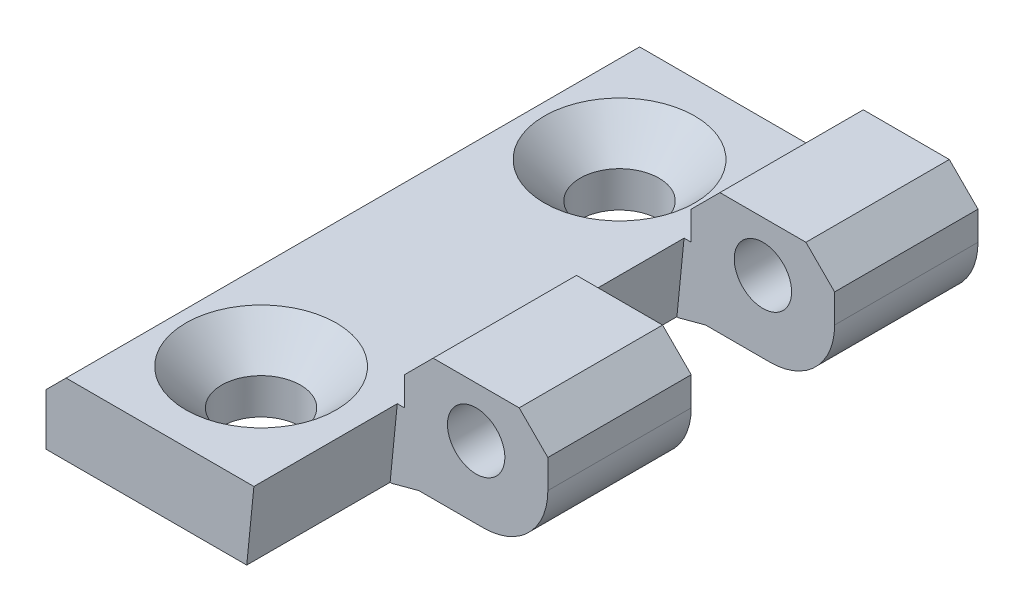
ISO-10303-21;
HEADER;
FILE_DESCRIPTION(('STEP AP214'),'2;1');
FILE_NAME('part.step','',(''),(''),'','','');
FILE_SCHEMA(('AUTOMOTIVE_DESIGN { 1 0 10303 214 1 1 1 1 }'));
ENDSEC;
DATA;
#1=APPLICATION_CONTEXT('core data for automotive mechanical design processes');
#2=APPLICATION_PROTOCOL_DEFINITION('international standard','automotive_design',2000,#1);
#3=PRODUCT_CONTEXT('',#1,'mechanical');
#4=PRODUCT('Part','Part','',(#3));
#5=PRODUCT_RELATED_PRODUCT_CATEGORY('part','',(#4));
#6=PRODUCT_DEFINITION_FORMATION('','',#4);
#7=PRODUCT_DEFINITION_CONTEXT('part definition',#1,'design');
#8=PRODUCT_DEFINITION('design','',#6,#7);
#9=PRODUCT_DEFINITION_SHAPE('','',#8);
#10=(LENGTH_UNIT() NAMED_UNIT(*) SI_UNIT(.MILLI.,.METRE.));
#11=(NAMED_UNIT(*) PLANE_ANGLE_UNIT() SI_UNIT($,.RADIAN.));
#12=(NAMED_UNIT(*) SI_UNIT($,.STERADIAN.) SOLID_ANGLE_UNIT());
#13=UNCERTAINTY_MEASURE_WITH_UNIT(LENGTH_MEASURE(1.E-05),#10,'distance_accuracy_value','');
#14=(GEOMETRIC_REPRESENTATION_CONTEXT(3) GLOBAL_UNCERTAINTY_ASSIGNED_CONTEXT((#13)) GLOBAL_UNIT_ASSIGNED_CONTEXT((#10,
#11,#12)) REPRESENTATION_CONTEXT('',''));
#15=CARTESIAN_POINT('',(0.,0.,0.));
#16=DIRECTION('',(0.,0.,1.));
#17=DIRECTION('',(1.,0.,0.));
#18=AXIS2_PLACEMENT_3D('',#15,#16,#17);
#19=CARTESIAN_POINT('',(0.499999999999999,5.,10.));
#20=DIRECTION('',(0.,0.,-1.));
#21=DIRECTION('',(-1.,0.,0.));
#22=AXIS2_PLACEMENT_3D('',#19,#20,#21);
#23=CYLINDRICAL_SURFACE('',#22,4.5);
#24=CARTESIAN_POINT('',(0.499999999999999,5.,10.));
#25=DIRECTION('',(0.,0.,-1.));
#26=DIRECTION('',(-1.,0.,0.));
#27=AXIS2_PLACEMENT_3D('',#24,#25,#26);
#28=CIRCLE('',#27,4.5);
#29=CARTESIAN_POINT('',(0.5,0.5,10.));
#30=VERTEX_POINT('',#29);
#31=CARTESIAN_POINT('',(5.,5.,10.));
#32=VERTEX_POINT('',#31);
#33=EDGE_CURVE('E19',#30,#32,#28,.F.);
#34=ORIENTED_EDGE('',*,*,#33,.F.);
#35=DIRECTION('',(0.,0.,1.));
#36=VECTOR('',#35,1.);
#37=CARTESIAN_POINT('',(0.5,0.5,10.));
#38=LINE('',#37,#36);
#39=CARTESIAN_POINT('',(0.5,0.5,0.));
#40=VERTEX_POINT('',#39);
#41=EDGE_CURVE('E120',#30,#40,#38,.F.);
#42=ORIENTED_EDGE('',*,*,#41,.T.);
#43=CARTESIAN_POINT('',(0.499999999999999,5.,0.));
#44=DIRECTION('',(0.,0.,-1.));
#45=DIRECTION('',(-1.,0.,0.));
#46=AXIS2_PLACEMENT_3D('',#43,#44,#45);
#47=CIRCLE('',#46,4.5);
#48=CARTESIAN_POINT('',(5.,5.,0.));
#49=VERTEX_POINT('',#48);
#50=EDGE_CURVE('E195',#40,#49,#47,.F.);
#51=ORIENTED_EDGE('',*,*,#50,.T.);
#52=DIRECTION('',(0.,0.,1.));
#53=VECTOR('',#52,1.);
#54=CARTESIAN_POINT('',(5.,5.,10.));
#55=LINE('',#54,#53);
#56=EDGE_CURVE('E122',#49,#32,#55,.T.);
#57=ORIENTED_EDGE('',*,*,#56,.T.);
#58=EDGE_LOOP('',(#34,#42,#51,#57));
#59=FACE_BOUND('',#58,.T.);
#60=ADVANCED_FACE('F16',(#59),#23,.T.);
#61=CARTESIAN_POINT('',(5.,5.,10.));
#62=DIRECTION('',(-1.,0.,0.));
#63=DIRECTION('',(0.,0.,1.));
#64=AXIS2_PLACEMENT_3D('',#61,#62,#63);
#65=PLANE('',#64);
#66=DIRECTION('',(0.,0.,1.));
#67=VECTOR('',#66,1.);
#68=CARTESIAN_POINT('',(5.,7.,10.));
#69=LINE('',#68,#67);
#70=CARTESIAN_POINT('',(5.,7.,0.));
#71=VERTEX_POINT('',#70);
#72=CARTESIAN_POINT('',(5.,7.,10.));
#73=VERTEX_POINT('',#72);
#74=EDGE_CURVE('E257',#71,#73,#69,.T.);
#75=ORIENTED_EDGE('',*,*,#74,.T.);
#76=DIRECTION('',(0.,1.,0.));
#77=VECTOR('',#76,1.);
#78=CARTESIAN_POINT('',(5.,5.,10.));
#79=LINE('',#78,#77);
#80=EDGE_CURVE('E126',#32,#73,#79,.T.);
#81=ORIENTED_EDGE('',*,*,#80,.F.);
#82=ORIENTED_EDGE('',*,*,#56,.F.);
#83=DIRECTION('',(0.,1.,0.));
#84=VECTOR('',#83,1.);
#85=CARTESIAN_POINT('',(5.,5.,0.));
#86=LINE('',#85,#84);
#87=EDGE_CURVE('E196',#49,#71,#86,.T.);
#88=ORIENTED_EDGE('',*,*,#87,.T.);
#89=EDGE_LOOP('',(#75,#81,#82,#88));
#90=FACE_BOUND('',#89,.T.);
#91=ADVANCED_FACE('F428',(#90),#65,.F.);
#92=CARTESIAN_POINT('',(5.,7.,10.));
#93=DIRECTION('',(-0.707106781186548,-0.707106781186547,0.));
#94=DIRECTION('',(0.707106781186547,-0.707106781186548,0.));
#95=AXIS2_PLACEMENT_3D('',#92,#93,#94);
#96=PLANE('',#95);
#97=DIRECTION('',(0.,0.,-1.));
#98=VECTOR('',#97,1.);
#99=CARTESIAN_POINT('',(3.,9.,10.));
#100=LINE('',#99,#98);
#101=CARTESIAN_POINT('',(3.,9.,0.));
#102=VERTEX_POINT('',#101);
#103=CARTESIAN_POINT('',(3.,9.,10.));
#104=VERTEX_POINT('',#103);
#105=EDGE_CURVE('E254',#102,#104,#100,.F.);
#106=ORIENTED_EDGE('',*,*,#105,.T.);
#107=DIRECTION('',(-0.707106781186547,0.707106781186548,0.));
#108=VECTOR('',#107,1.);
#109=CARTESIAN_POINT('',(5.,7.,10.));
#110=LINE('',#109,#108);
#111=EDGE_CURVE('E157',#73,#104,#110,.T.);
#112=ORIENTED_EDGE('',*,*,#111,.F.);
#113=ORIENTED_EDGE('',*,*,#74,.F.);
#114=DIRECTION('',(-0.707106781186547,0.707106781186548,0.));
#115=VECTOR('',#114,1.);
#116=CARTESIAN_POINT('',(5.,7.,0.));
#117=LINE('',#116,#115);
#118=EDGE_CURVE('E198',#71,#102,#117,.T.);
#119=ORIENTED_EDGE('',*,*,#118,.T.);
#120=EDGE_LOOP('',(#106,#112,#113,#119));
#121=FACE_BOUND('',#120,.T.);
#122=ADVANCED_FACE('F425',(#121),#96,.F.);
#123=CARTESIAN_POINT('',(3.,9.,10.));
#124=DIRECTION('',(0.,-1.,0.));
#125=DIRECTION('',(0.,0.,-1.));
#126=AXIS2_PLACEMENT_3D('',#123,#124,#125);
#127=PLANE('',#126);
#128=DIRECTION('',(0.,0.,1.));
#129=VECTOR('',#128,1.);
#130=CARTESIAN_POINT('',(-3.,9.,10.));
#131=LINE('',#130,#129);
#132=CARTESIAN_POINT('',(-3.,9.,0.));
#133=VERTEX_POINT('',#132);
#134=CARTESIAN_POINT('',(-3.,9.,10.));
#135=VERTEX_POINT('',#134);
#136=EDGE_CURVE('E217',#133,#135,#131,.T.);
#137=ORIENTED_EDGE('',*,*,#136,.T.);
#138=DIRECTION('',(1.,0.,0.));
#139=VECTOR('',#138,1.);
#140=CARTESIAN_POINT('',(0.499999999999999,9.,10.));
#141=LINE('',#140,#139);
#142=EDGE_CURVE('E159',#104,#135,#141,.F.);
#143=ORIENTED_EDGE('',*,*,#142,.F.);
#144=ORIENTED_EDGE('',*,*,#105,.F.);
#145=DIRECTION('',(1.,0.,0.));
#146=VECTOR('',#145,1.);
#147=CARTESIAN_POINT('',(0.499999999999999,9.,0.));
#148=LINE('',#147,#146);
#149=EDGE_CURVE('E261',#102,#133,#148,.F.);
#150=ORIENTED_EDGE('',*,*,#149,.T.);
#151=EDGE_LOOP('',(#137,#143,#144,#150));
#152=FACE_BOUND('',#151,.T.);
#153=ADVANCED_FACE('F417',(#152),#127,.F.);
#154=CARTESIAN_POINT('',(-3.,9.,10.));
#155=DIRECTION('',(0.707106781186548,-0.707106781186547,0.));
#156=DIRECTION('',(0.707106781186547,0.707106781186548,0.));
#157=AXIS2_PLACEMENT_3D('',#154,#155,#156);
#158=PLANE('',#157);
#159=DIRECTION('',(0.,0.,-1.));
#160=VECTOR('',#159,1.);
#161=CARTESIAN_POINT('',(-5.,7.,10.));
#162=LINE('',#161,#160);
#163=CARTESIAN_POINT('',(-5.,7.,0.));
#164=VERTEX_POINT('',#163);
#165=CARTESIAN_POINT('',(-5.,7.,10.));
#166=VERTEX_POINT('',#165);
#167=EDGE_CURVE('E214',#164,#166,#162,.F.);
#168=ORIENTED_EDGE('',*,*,#167,.T.);
#169=DIRECTION('',(-0.707106781186547,-0.707106781186548,0.));
#170=VECTOR('',#169,1.);
#171=CARTESIAN_POINT('',(-3.,9.,10.));
#172=LINE('',#171,#170);
#173=EDGE_CURVE('E207',#135,#166,#172,.T.);
#174=ORIENTED_EDGE('',*,*,#173,.F.);
#175=ORIENTED_EDGE('',*,*,#136,.F.);
#176=DIRECTION('',(-0.707106781186547,-0.707106781186548,0.));
#177=VECTOR('',#176,1.);
#178=CARTESIAN_POINT('',(-3.,9.,0.));
#179=LINE('',#178,#177);
#180=EDGE_CURVE('E411',#133,#164,#179,.T.);
#181=ORIENTED_EDGE('',*,*,#180,.T.);
#182=EDGE_LOOP('',(#168,#174,#175,#181));
#183=FACE_BOUND('',#182,.T.);
#184=ADVANCED_FACE('F432',(#183),#158,.F.);
#185=CARTESIAN_POINT('',(0.,5.5,10.));
#186=DIRECTION('',(0.,0.,-1.));
#187=DIRECTION('',(-1.,0.,0.));
#188=AXIS2_PLACEMENT_3D('',#185,#186,#187);
#189=CYLINDRICAL_SURFACE('',#188,2.);
#190=CARTESIAN_POINT('',(0.,5.5,0.));
#191=DIRECTION('',(0.,0.,-1.));
#192=DIRECTION('',(-1.,0.,0.));
#193=AXIS2_PLACEMENT_3D('',#190,#191,#192);
#194=CIRCLE('',#193,2.);
#195=CARTESIAN_POINT('',(-2.,5.5,0.));
#196=VERTEX_POINT('',#195);
#197=EDGE_CURVE('E190',#196,#196,#194,.T.);
#198=ORIENTED_EDGE('',*,*,#197,.T.);
#199=EDGE_LOOP('',(#198));
#200=FACE_BOUND('',#199,.T.);
#201=CARTESIAN_POINT('',(0.,5.5,10.));
#202=DIRECTION('',(0.,0.,-1.));
#203=DIRECTION('',(-1.,0.,0.));
#204=AXIS2_PLACEMENT_3D('',#201,#202,#203);
#205=CIRCLE('',#204,2.);
#206=CARTESIAN_POINT('',(-2.,5.5,10.));
#207=VERTEX_POINT('',#206);
#208=EDGE_CURVE('E142',#207,#207,#205,.T.);
#209=ORIENTED_EDGE('',*,*,#208,.F.);
#210=EDGE_LOOP('',(#209));
#211=FACE_BOUND('',#210,.T.);
#212=ADVANCED_FACE('F620',(#200,#211),#189,.F.);
#213=CARTESIAN_POINT('',(-5.,7.,10.));
#214=DIRECTION('',(1.,0.,0.));
#215=DIRECTION('',(0.,0.,-1.));
#216=AXIS2_PLACEMENT_3D('',#213,#214,#215);
#217=PLANE('',#216);
#218=DIRECTION('',(0.,0.,-1.));
#219=VECTOR('',#218,1.);
#220=CARTESIAN_POINT('',(-5.,5.,20.));
#221=LINE('',#220,#219);
#222=CARTESIAN_POINT('',(-5.,5.00000000000001,0.));
#223=VERTEX_POINT('',#222);
#224=CARTESIAN_POINT('',(-5.,5.00000000000001,10.));
#225=VERTEX_POINT('',#224);
#226=EDGE_CURVE('E437',#223,#225,#221,.F.);
#227=ORIENTED_EDGE('',*,*,#226,.T.);
#228=DIRECTION('',(0.,1.,0.));
#229=VECTOR('',#228,1.);
#230=CARTESIAN_POINT('',(-5.,5.,10.));
#231=LINE('',#230,#229);
#232=EDGE_CURVE('E145',#166,#225,#231,.F.);
#233=ORIENTED_EDGE('',*,*,#232,.F.);
#234=ORIENTED_EDGE('',*,*,#167,.F.);
#235=DIRECTION('',(0.,1.,0.));
#236=VECTOR('',#235,1.);
#237=CARTESIAN_POINT('',(-5.,5.,0.));
#238=LINE('',#237,#236);
#239=EDGE_CURVE('E409',#164,#223,#238,.F.);
#240=ORIENTED_EDGE('',*,*,#239,.T.);
#241=EDGE_LOOP('',(#227,#233,#234,#240));
#242=FACE_BOUND('',#241,.T.);
#243=ADVANCED_FACE('F435',(#242),#217,.F.);
#244=CARTESIAN_POINT('',(0.499999999999999,5.,10.));
#245=DIRECTION('',(0.,0.,1.));
#246=DIRECTION('',(1.,0.,0.));
#247=AXIS2_PLACEMENT_3D('',#244,#245,#246);
#248=PLANE('',#247);
#249=ORIENTED_EDGE('',*,*,#208,.T.);
#250=EDGE_LOOP('',(#249));
#251=FACE_BOUND('',#250,.T.);
#252=ORIENTED_EDGE('',*,*,#232,.T.);
#253=DIRECTION('',(1.,0.,0.));
#254=VECTOR('',#253,1.);
#255=CARTESIAN_POINT('',(-5.5,5.,10.));
#256=LINE('',#255,#254);
#257=CARTESIAN_POINT('',(-5.5,5.,10.));
#258=VERTEX_POINT('',#257);
#259=EDGE_CURVE('E440',#225,#258,#256,.F.);
#260=ORIENTED_EDGE('',*,*,#259,.T.);
#261=DIRECTION('',(-0.099503719020999,-0.995037190209989,0.));
#262=VECTOR('',#261,1.);
#263=CARTESIAN_POINT('',(-6.,0.,10.));
#264=LINE('',#263,#262);
#265=CARTESIAN_POINT('',(-6.,0.,10.));
#266=VERTEX_POINT('',#265);
#267=EDGE_CURVE('E154',#258,#266,#264,.T.);
#268=ORIENTED_EDGE('',*,*,#267,.T.);
#269=DIRECTION('',(1.,0.,0.));
#270=VECTOR('',#269,1.);
#271=CARTESIAN_POINT('',(0.499999999999999,0.,10.));
#272=LINE('',#271,#270);
#273=CARTESIAN_POINT('',(-5.86602540378444,0.,10.));
#274=VERTEX_POINT('',#273);
#275=EDGE_CURVE('E127',#266,#274,#272,.T.);
#276=ORIENTED_EDGE('',*,*,#275,.T.);
#277=DIRECTION('',(-0.965925826289068,-0.258819045102521,0.));
#278=VECTOR('',#277,1.);
#279=CARTESIAN_POINT('',(-5.86602540378444,0.,10.));
#280=LINE('',#279,#278);
#281=CARTESIAN_POINT('',(-4.,0.5,10.));
#282=VERTEX_POINT('',#281);
#283=EDGE_CURVE('E141',#274,#282,#280,.F.);
#284=ORIENTED_EDGE('',*,*,#283,.T.);
#285=DIRECTION('',(1.,0.,0.));
#286=VECTOR('',#285,1.);
#287=CARTESIAN_POINT('',(-4.,0.5,10.));
#288=LINE('',#287,#286);
#289=EDGE_CURVE('E132',#282,#30,#288,.T.);
#290=ORIENTED_EDGE('',*,*,#289,.T.);
#291=ORIENTED_EDGE('',*,*,#33,.T.);
#292=ORIENTED_EDGE('',*,*,#80,.T.);
#293=ORIENTED_EDGE('',*,*,#111,.T.);
#294=ORIENTED_EDGE('',*,*,#142,.T.);
#295=ORIENTED_EDGE('',*,*,#173,.T.);
#296=EDGE_LOOP('',(#252,#260,#268,#276,#284,#290,#291,#292,#293,#294,#295));
#297=FACE_BOUND('',#296,.T.);
#298=ADVANCED_FACE('F138',(#251,#297),#248,.T.);
#299=CARTESIAN_POINT('',(-4.,0.5,10.));
#300=DIRECTION('',(0.,1.,0.));
#301=DIRECTION('',(0.,0.,1.));
#302=AXIS2_PLACEMENT_3D('',#299,#300,#301);
#303=PLANE('',#302);
#304=ORIENTED_EDGE('',*,*,#41,.F.);
#305=ORIENTED_EDGE('',*,*,#289,.F.);
#306=DIRECTION('',(0.,0.,1.));
#307=VECTOR('',#306,1.);
#308=CARTESIAN_POINT('',(-4.,0.499999999999999,10.));
#309=LINE('',#308,#307);
#310=CARTESIAN_POINT('',(-4.00000000000001,0.499999999999999,0.));
#311=VERTEX_POINT('',#310);
#312=EDGE_CURVE('E153',#282,#311,#309,.F.);
#313=ORIENTED_EDGE('',*,*,#312,.T.);
#314=DIRECTION('',(1.,0.,0.));
#315=VECTOR('',#314,1.);
#316=CARTESIAN_POINT('',(0.499999999999999,0.5,0.));
#317=LINE('',#316,#315);
#318=EDGE_CURVE('E134',#311,#40,#317,.T.);
#319=ORIENTED_EDGE('',*,*,#318,.T.);
#320=EDGE_LOOP('',(#304,#305,#313,#319));
#321=FACE_BOUND('',#320,.T.);
#322=ADVANCED_FACE('F130',(#321),#303,.F.);
#323=CARTESIAN_POINT('',(0.499999999999999,5.,0.));
#324=DIRECTION('',(0.,0.,1.));
#325=DIRECTION('',(1.,0.,0.));
#326=AXIS2_PLACEMENT_3D('',#323,#324,#325);
#327=PLANE('',#326);
#328=ORIENTED_EDGE('',*,*,#197,.F.);
#329=EDGE_LOOP('',(#328));
#330=FACE_BOUND('',#329,.T.);
#331=DIRECTION('',(-0.099503719020999,-0.995037190209989,0.));
#332=VECTOR('',#331,1.);
#333=CARTESIAN_POINT('',(-6.,0.,0.));
#334=LINE('',#333,#332);
#335=CARTESIAN_POINT('',(-6.,0.,0.));
#336=VERTEX_POINT('',#335);
#337=CARTESIAN_POINT('',(-5.5,5.00000000000001,0.));
#338=VERTEX_POINT('',#337);
#339=EDGE_CURVE('E271',#336,#338,#334,.F.);
#340=ORIENTED_EDGE('',*,*,#339,.T.);
#341=DIRECTION('',(1.,0.,0.));
#342=VECTOR('',#341,1.);
#343=CARTESIAN_POINT('',(-5.5,5.,0.));
#344=LINE('',#343,#342);
#345=EDGE_CURVE('E441',#338,#223,#344,.T.);
#346=ORIENTED_EDGE('',*,*,#345,.T.);
#347=ORIENTED_EDGE('',*,*,#239,.F.);
#348=ORIENTED_EDGE('',*,*,#180,.F.);
#349=ORIENTED_EDGE('',*,*,#149,.F.);
#350=ORIENTED_EDGE('',*,*,#118,.F.);
#351=ORIENTED_EDGE('',*,*,#87,.F.);
#352=ORIENTED_EDGE('',*,*,#50,.F.);
#353=ORIENTED_EDGE('',*,*,#318,.F.);
#354=DIRECTION('',(-0.965925826289068,-0.258819045102521,0.));
#355=VECTOR('',#354,1.);
#356=CARTESIAN_POINT('',(-5.86602540378444,0.,0.));
#357=LINE('',#356,#355);
#358=CARTESIAN_POINT('',(-5.86602540378443,0.,0.));
#359=VERTEX_POINT('',#358);
#360=EDGE_CURVE('E268',#311,#359,#357,.T.);
#361=ORIENTED_EDGE('',*,*,#360,.T.);
#362=DIRECTION('',(1.,0.,0.));
#363=VECTOR('',#362,1.);
#364=CARTESIAN_POINT('',(0.499999999999999,0.,0.));
#365=LINE('',#364,#363);
#366=EDGE_CURVE('E194',#336,#359,#365,.T.);
#367=ORIENTED_EDGE('',*,*,#366,.F.);
#368=EDGE_LOOP('',(#340,#346,#347,#348,#349,#350,#351,#352,#353,#361,#367));
#369=FACE_BOUND('',#368,.T.);
#370=ADVANCED_FACE('F283',(#330,#369),#327,.F.);
#371=CARTESIAN_POINT('',(0.499999999999999,5.,-10.));
#372=DIRECTION('',(0.,0.,1.));
#373=DIRECTION('',(1.,0.,0.));
#374=AXIS2_PLACEMENT_3D('',#371,#372,#373);
#375=PLANE('',#374);
#376=CARTESIAN_POINT('',(0.,5.5,-10.));
#377=DIRECTION('',(0.,0.,1.));
#378=DIRECTION('',(1.,0.,0.));
#379=AXIS2_PLACEMENT_3D('',#376,#377,#378);
#380=CIRCLE('',#379,2.);
#381=CARTESIAN_POINT('',(2.,5.5,-10.));
#382=VERTEX_POINT('',#381);
#383=EDGE_CURVE('E182',#382,#382,#380,.F.);
#384=ORIENTED_EDGE('',*,*,#383,.T.);
#385=EDGE_LOOP('',(#384));
#386=FACE_BOUND('',#385,.T.);
#387=DIRECTION('',(0.,1.,0.));
#388=VECTOR('',#387,1.);
#389=CARTESIAN_POINT('',(-5.,7.,-10.));
#390=LINE('',#389,#388);
#391=CARTESIAN_POINT('',(-5.,5.00000000000001,-10.));
#392=VERTEX_POINT('',#391);
#393=CARTESIAN_POINT('',(-5.,7.,-10.));
#394=VERTEX_POINT('',#393);
#395=EDGE_CURVE('E345',#392,#394,#390,.T.);
#396=ORIENTED_EDGE('',*,*,#395,.F.);
#397=DIRECTION('',(1.,0.,0.));
#398=VECTOR('',#397,1.);
#399=CARTESIAN_POINT('',(-5.5,5.,-10.));
#400=LINE('',#399,#398);
#401=CARTESIAN_POINT('',(-5.5,5.,-10.));
#402=VERTEX_POINT('',#401);
#403=EDGE_CURVE('E444',#392,#402,#400,.F.);
#404=ORIENTED_EDGE('',*,*,#403,.T.);
#405=DIRECTION('',(-0.099503719020999,-0.995037190209989,0.));
#406=VECTOR('',#405,1.);
#407=CARTESIAN_POINT('',(-6.,0.,-10.));
#408=LINE('',#407,#406);
#409=CARTESIAN_POINT('',(-6.,0.,-10.));
#410=VERTEX_POINT('',#409);
#411=EDGE_CURVE('E238',#402,#410,#408,.T.);
#412=ORIENTED_EDGE('',*,*,#411,.T.);
#413=DIRECTION('',(1.,0.,0.));
#414=VECTOR('',#413,1.);
#415=CARTESIAN_POINT('',(0.499999999999999,0.,-10.));
#416=LINE('',#415,#414);
#417=CARTESIAN_POINT('',(-5.86602540378444,0.,-10.));
#418=VERTEX_POINT('',#417);
#419=EDGE_CURVE('E193',#410,#418,#416,.T.);
#420=ORIENTED_EDGE('',*,*,#419,.T.);
#421=DIRECTION('',(0.965925826289068,0.258819045102521,0.));
#422=VECTOR('',#421,1.);
#423=CARTESIAN_POINT('',(-5.86602540378444,0.,-10.));
#424=LINE('',#423,#422);
#425=CARTESIAN_POINT('',(-4.,0.5,-10.));
#426=VERTEX_POINT('',#425);
#427=EDGE_CURVE('E241',#426,#418,#424,.F.);
#428=ORIENTED_EDGE('',*,*,#427,.F.);
#429=DIRECTION('',(1.,0.,0.));
#430=VECTOR('',#429,1.);
#431=CARTESIAN_POINT('',(-4.,0.5,-10.));
#432=LINE('',#431,#430);
#433=CARTESIAN_POINT('',(0.499999999999999,0.5,-10.));
#434=VERTEX_POINT('',#433);
#435=EDGE_CURVE('E189',#434,#426,#432,.F.);
#436=ORIENTED_EDGE('',*,*,#435,.F.);
#437=CARTESIAN_POINT('',(0.499999999999999,5.,-10.));
#438=DIRECTION('',(0.,0.,1.));
#439=DIRECTION('',(1.,0.,0.));
#440=AXIS2_PLACEMENT_3D('',#437,#438,#439);
#441=CIRCLE('',#440,4.5);
#442=CARTESIAN_POINT('',(5.,5.,-10.));
#443=VERTEX_POINT('',#442);
#444=EDGE_CURVE('E186',#443,#434,#441,.F.);
#445=ORIENTED_EDGE('',*,*,#444,.F.);
#446=DIRECTION('',(0.,1.,0.));
#447=VECTOR('',#446,1.);
#448=CARTESIAN_POINT('',(5.,5.,-10.));
#449=LINE('',#448,#447);
#450=CARTESIAN_POINT('',(5.,7.,-10.));
#451=VERTEX_POINT('',#450);
#452=EDGE_CURVE('E218',#451,#443,#449,.F.);
#453=ORIENTED_EDGE('',*,*,#452,.F.);
#454=DIRECTION('',(-0.707106781186547,0.707106781186548,0.));
#455=VECTOR('',#454,1.);
#456=CARTESIAN_POINT('',(5.,7.,-10.));
#457=LINE('',#456,#455);
#458=CARTESIAN_POINT('',(3.,9.,-10.));
#459=VERTEX_POINT('',#458);
#460=EDGE_CURVE('E223',#459,#451,#457,.F.);
#461=ORIENTED_EDGE('',*,*,#460,.F.);
#462=DIRECTION('',(1.,0.,0.));
#463=VECTOR('',#462,1.);
#464=CARTESIAN_POINT('',(3.,9.,-10.));
#465=LINE('',#464,#463);
#466=CARTESIAN_POINT('',(-3.,9.,-10.));
#467=VERTEX_POINT('',#466);
#468=EDGE_CURVE('E228',#467,#459,#465,.T.);
#469=ORIENTED_EDGE('',*,*,#468,.F.);
#470=DIRECTION('',(-0.707106781186547,-0.707106781186548,0.));
#471=VECTOR('',#470,1.);
#472=CARTESIAN_POINT('',(-3.,9.,-10.));
#473=LINE('',#472,#471);
#474=EDGE_CURVE('E235',#394,#467,#473,.F.);
#475=ORIENTED_EDGE('',*,*,#474,.F.);
#476=EDGE_LOOP('',(#396,#404,#412,#420,#428,#436,#445,#453,#461,#469,#475));
#477=FACE_BOUND('',#476,.T.);
#478=ADVANCED_FACE('F360',(#386,#477),#375,.T.);
#479=CARTESIAN_POINT('',(-4.,0.5,-20.));
#480=DIRECTION('',(0.,-1.,0.));
#481=DIRECTION('',(0.,0.,-1.));
#482=AXIS2_PLACEMENT_3D('',#479,#480,#481);
#483=PLANE('',#482);
#484=DIRECTION('',(1.,0.,0.));
#485=VECTOR('',#484,1.);
#486=CARTESIAN_POINT('',(0.,0.5,-20.));
#487=LINE('',#486,#485);
#488=CARTESIAN_POINT('',(-4.,0.5,-20.));
#489=VERTEX_POINT('',#488);
#490=CARTESIAN_POINT('',(0.499999999999999,0.5,-20.));
#491=VERTEX_POINT('',#490);
#492=EDGE_CURVE('E174',#489,#491,#487,.T.);
#493=ORIENTED_EDGE('',*,*,#492,.T.);
#494=DIRECTION('',(0.,0.,1.));
#495=VECTOR('',#494,1.);
#496=CARTESIAN_POINT('',(0.499999999999998,0.5,-20.));
#497=LINE('',#496,#495);
#498=EDGE_CURVE('E188',#434,#491,#497,.F.);
#499=ORIENTED_EDGE('',*,*,#498,.F.);
#500=ORIENTED_EDGE('',*,*,#435,.T.);
#501=DIRECTION('',(0.,0.,1.));
#502=VECTOR('',#501,1.);
#503=CARTESIAN_POINT('',(-4.,0.499999999999999,-20.));
#504=LINE('',#503,#502);
#505=EDGE_CURVE('E386',#489,#426,#504,.T.);
#506=ORIENTED_EDGE('',*,*,#505,.F.);
#507=EDGE_LOOP('',(#493,#499,#500,#506));
#508=FACE_BOUND('',#507,.T.);
#509=ADVANCED_FACE('F602',(#508),#483,.T.);
#510=CARTESIAN_POINT('',(0.499999999999999,5.,-20.));
#511=DIRECTION('',(0.,0.,1.));
#512=DIRECTION('',(1.,0.,0.));
#513=AXIS2_PLACEMENT_3D('',#510,#511,#512);
#514=CYLINDRICAL_SURFACE('',#513,4.5);
#515=CARTESIAN_POINT('',(0.499999999999999,5.,-20.));
#516=DIRECTION('',(0.,0.,1.));
#517=DIRECTION('',(1.,0.,0.));
#518=AXIS2_PLACEMENT_3D('',#515,#516,#517);
#519=CIRCLE('',#518,4.5);
#520=CARTESIAN_POINT('',(5.,5.,-20.));
#521=VERTEX_POINT('',#520);
#522=EDGE_CURVE('E170',#491,#521,#519,.T.);
#523=ORIENTED_EDGE('',*,*,#522,.T.);
#524=DIRECTION('',(0.,0.,-1.));
#525=VECTOR('',#524,1.);
#526=CARTESIAN_POINT('',(5.,5.,-20.));
#527=LINE('',#526,#525);
#528=EDGE_CURVE('E220',#443,#521,#527,.T.);
#529=ORIENTED_EDGE('',*,*,#528,.F.);
#530=ORIENTED_EDGE('',*,*,#444,.T.);
#531=ORIENTED_EDGE('',*,*,#498,.T.);
#532=EDGE_LOOP('',(#523,#529,#530,#531));
#533=FACE_BOUND('',#532,.T.);
#534=ADVANCED_FACE('F598',(#533),#514,.T.);
#535=CARTESIAN_POINT('',(5.,5.,-20.));
#536=DIRECTION('',(1.,0.,0.));
#537=DIRECTION('',(0.,0.,-1.));
#538=AXIS2_PLACEMENT_3D('',#535,#536,#537);
#539=PLANE('',#538);
#540=DIRECTION('',(0.,1.,0.));
#541=VECTOR('',#540,1.);
#542=CARTESIAN_POINT('',(5.,0.,-20.));
#543=LINE('',#542,#541);
#544=CARTESIAN_POINT('',(5.,7.,-20.));
#545=VERTEX_POINT('',#544);
#546=EDGE_CURVE('E173',#521,#545,#543,.T.);
#547=ORIENTED_EDGE('',*,*,#546,.T.);
#548=DIRECTION('',(0.,0.,1.));
#549=VECTOR('',#548,1.);
#550=CARTESIAN_POINT('',(5.,7.,-20.));
#551=LINE('',#550,#549);
#552=EDGE_CURVE('E225',#451,#545,#551,.F.);
#553=ORIENTED_EDGE('',*,*,#552,.F.);
#554=ORIENTED_EDGE('',*,*,#452,.T.);
#555=ORIENTED_EDGE('',*,*,#528,.T.);
#556=EDGE_LOOP('',(#547,#553,#554,#555));
#557=FACE_BOUND('',#556,.T.);
#558=ADVANCED_FACE('F594',(#557),#539,.T.);
#559=CARTESIAN_POINT('',(5.,7.,-20.));
#560=DIRECTION('',(0.707106781186548,0.707106781186547,0.));
#561=DIRECTION('',(-0.707106781186547,0.707106781186548,0.));
#562=AXIS2_PLACEMENT_3D('',#559,#560,#561);
#563=PLANE('',#562);
#564=DIRECTION('',(-0.707106781186547,0.707106781186548,0.));
#565=VECTOR('',#564,1.);
#566=CARTESIAN_POINT('',(5.,7.,-20.));
#567=LINE('',#566,#565);
#568=CARTESIAN_POINT('',(3.,9.,-20.));
#569=VERTEX_POINT('',#568);
#570=EDGE_CURVE('E373',#545,#569,#567,.T.);
#571=ORIENTED_EDGE('',*,*,#570,.T.);
#572=DIRECTION('',(0.,0.,1.));
#573=VECTOR('',#572,1.);
#574=CARTESIAN_POINT('',(3.,9.,-20.));
#575=LINE('',#574,#573);
#576=EDGE_CURVE('E230',#459,#569,#575,.F.);
#577=ORIENTED_EDGE('',*,*,#576,.F.);
#578=ORIENTED_EDGE('',*,*,#460,.T.);
#579=ORIENTED_EDGE('',*,*,#552,.T.);
#580=EDGE_LOOP('',(#571,#577,#578,#579));
#581=FACE_BOUND('',#580,.T.);
#582=ADVANCED_FACE('F591',(#581),#563,.T.);
#583=CARTESIAN_POINT('',(3.,9.,-20.));
#584=DIRECTION('',(0.,1.,0.));
#585=DIRECTION('',(0.,0.,1.));
#586=AXIS2_PLACEMENT_3D('',#583,#584,#585);
#587=PLANE('',#586);
#588=DIRECTION('',(1.,0.,0.));
#589=VECTOR('',#588,1.);
#590=CARTESIAN_POINT('',(0.,9.,-20.));
#591=LINE('',#590,#589);
#592=CARTESIAN_POINT('',(-3.,9.,-20.));
#593=VERTEX_POINT('',#592);
#594=EDGE_CURVE('E367',#569,#593,#591,.F.);
#595=ORIENTED_EDGE('',*,*,#594,.T.);
#596=DIRECTION('',(0.,0.,1.));
#597=VECTOR('',#596,1.);
#598=CARTESIAN_POINT('',(-3.,9.,-20.));
#599=LINE('',#598,#597);
#600=EDGE_CURVE('E354',#467,#593,#599,.F.);
#601=ORIENTED_EDGE('',*,*,#600,.F.);
#602=ORIENTED_EDGE('',*,*,#468,.T.);
#603=ORIENTED_EDGE('',*,*,#576,.T.);
#604=EDGE_LOOP('',(#595,#601,#602,#603));
#605=FACE_BOUND('',#604,.T.);
#606=ADVANCED_FACE('F365',(#605),#587,.T.);
#607=CARTESIAN_POINT('',(-3.,9.,-20.));
#608=DIRECTION('',(-0.707106781186548,0.707106781186547,0.));
#609=DIRECTION('',(-0.707106781186547,-0.707106781186548,0.));
#610=AXIS2_PLACEMENT_3D('',#607,#608,#609);
#611=PLANE('',#610);
#612=DIRECTION('',(-0.707106781186547,-0.707106781186548,0.));
#613=VECTOR('',#612,1.);
#614=CARTESIAN_POINT('',(-3.,9.,-20.));
#615=LINE('',#614,#613);
#616=CARTESIAN_POINT('',(-5.,7.,-20.));
#617=VERTEX_POINT('',#616);
#618=EDGE_CURVE('E456',#593,#617,#615,.T.);
#619=ORIENTED_EDGE('',*,*,#618,.T.);
#620=DIRECTION('',(0.,0.,1.));
#621=VECTOR('',#620,1.);
#622=CARTESIAN_POINT('',(-5.,7.,-20.));
#623=LINE('',#622,#621);
#624=EDGE_CURVE('E356',#394,#617,#623,.F.);
#625=ORIENTED_EDGE('',*,*,#624,.F.);
#626=ORIENTED_EDGE('',*,*,#474,.T.);
#627=ORIENTED_EDGE('',*,*,#600,.T.);
#628=EDGE_LOOP('',(#619,#625,#626,#627));
#629=FACE_BOUND('',#628,.T.);
#630=ADVANCED_FACE('F352',(#629),#611,.T.);
#631=CARTESIAN_POINT('',(-5.,7.,-20.));
#632=DIRECTION('',(-1.,0.,0.));
#633=DIRECTION('',(0.,0.,1.));
#634=AXIS2_PLACEMENT_3D('',#631,#632,#633);
#635=PLANE('',#634);
#636=DIRECTION('',(0.,1.,0.));
#637=VECTOR('',#636,1.);
#638=CARTESIAN_POINT('',(-5.,0.,-20.));
#639=LINE('',#638,#637);
#640=CARTESIAN_POINT('',(-5.,5.00000000000001,-20.));
#641=VERTEX_POINT('',#640);
#642=EDGE_CURVE('E453',#617,#641,#639,.F.);
#643=ORIENTED_EDGE('',*,*,#642,.T.);
#644=DIRECTION('',(0.,0.,-1.));
#645=VECTOR('',#644,1.);
#646=CARTESIAN_POINT('',(-5.,5.,20.));
#647=LINE('',#646,#645);
#648=EDGE_CURVE('E449',#641,#392,#647,.F.);
#649=ORIENTED_EDGE('',*,*,#648,.T.);
#650=ORIENTED_EDGE('',*,*,#395,.T.);
#651=ORIENTED_EDGE('',*,*,#624,.T.);
#652=EDGE_LOOP('',(#643,#649,#650,#651));
#653=FACE_BOUND('',#652,.T.);
#654=ADVANCED_FACE('F452',(#653),#635,.T.);
#655=CARTESIAN_POINT('',(-5.5,5.,20.));
#656=DIRECTION('',(0.,-1.,0.));
#657=DIRECTION('',(0.,0.,-1.));
#658=AXIS2_PLACEMENT_3D('',#655,#656,#657);
#659=PLANE('',#658);
#660=CARTESIAN_POINT('',(-12.5,4.99999999999545,-12.5));
#661=DIRECTION('',(0.,1.,0.));
#662=DIRECTION('',(0.,0.,1.));
#663=AXIS2_PLACEMENT_3D('',#660,#661,#662);
#664=CIRCLE('',#663,5.25000000000091);
#665=CARTESIAN_POINT('',(-12.5,4.99999999999545,-7.24999999999909));
#666=VERTEX_POINT('',#665);
#667=EDGE_CURVE('E175',#666,#666,#664,.F.);
#668=ORIENTED_EDGE('',*,*,#667,.T.);
#669=EDGE_LOOP('',(#668));
#670=FACE_BOUND('',#669,.T.);
#671=CARTESIAN_POINT('',(-12.5,4.99999999999545,12.5));
#672=DIRECTION('',(0.,1.,0.));
#673=DIRECTION('',(0.,0.,1.));
#674=AXIS2_PLACEMENT_3D('',#671,#672,#673);
#675=CIRCLE('',#674,5.24999999992133);
#676=CARTESIAN_POINT('',(-12.5,4.99999999999545,17.7499999999213));
#677=VERTEX_POINT('',#676);
#678=EDGE_CURVE('E179',#677,#677,#675,.F.);
#679=ORIENTED_EDGE('',*,*,#678,.T.);
#680=EDGE_LOOP('',(#679));
#681=FACE_BOUND('',#680,.T.);
#682=DIRECTION('',(0.,0.,1.));
#683=VECTOR('',#682,1.);
#684=CARTESIAN_POINT('',(-18.6,5.,20.));
#685=LINE('',#684,#683);
#686=CARTESIAN_POINT('',(-18.6,5.,-20.));
#687=VERTEX_POINT('',#686);
#688=CARTESIAN_POINT('',(-18.6,5.,20.));
#689=VERTEX_POINT('',#688);
#690=EDGE_CURVE('E185',#687,#689,#685,.T.);
#691=ORIENTED_EDGE('',*,*,#690,.T.);
#692=DIRECTION('',(1.,0.,0.));
#693=VECTOR('',#692,1.);
#694=CARTESIAN_POINT('',(0.,5.,20.));
#695=LINE('',#694,#693);
#696=CARTESIAN_POINT('',(-5.5,5.,20.));
#697=VERTEX_POINT('',#696);
#698=EDGE_CURVE('E489',#697,#689,#695,.F.);
#699=ORIENTED_EDGE('',*,*,#698,.F.);
#700=DIRECTION('',(0.,0.,1.));
#701=VECTOR('',#700,1.);
#702=CARTESIAN_POINT('',(-5.5,5.,20.));
#703=LINE('',#702,#701);
#704=EDGE_CURVE('E480',#697,#258,#703,.F.);
#705=ORIENTED_EDGE('',*,*,#704,.T.);
#706=ORIENTED_EDGE('',*,*,#259,.F.);
#707=ORIENTED_EDGE('',*,*,#226,.F.);
#708=ORIENTED_EDGE('',*,*,#345,.F.);
#709=DIRECTION('',(0.,0.,1.));
#710=VECTOR('',#709,1.);
#711=CARTESIAN_POINT('',(-5.5,5.00000000000001,20.));
#712=LINE('',#711,#710);
#713=EDGE_CURVE('E242',#338,#402,#712,.F.);
#714=ORIENTED_EDGE('',*,*,#713,.T.);
#715=ORIENTED_EDGE('',*,*,#403,.F.);
#716=ORIENTED_EDGE('',*,*,#648,.F.);
#717=DIRECTION('',(1.,0.,0.));
#718=VECTOR('',#717,1.);
#719=CARTESIAN_POINT('',(0.,5.00000000000001,-20.));
#720=LINE('',#719,#718);
#721=EDGE_CURVE('E459',#641,#687,#720,.F.);
#722=ORIENTED_EDGE('',*,*,#721,.T.);
#723=EDGE_LOOP('',(#691,#699,#705,#706,#707,#708,#714,#715,#716,#722));
#724=FACE_BOUND('',#723,.T.);
#725=ADVANCED_FACE('F501',(#670,#681,#724),#659,.F.);
#726=CARTESIAN_POINT('',(-18.6,5.,20.));
#727=DIRECTION('',(0.707106781186548,-0.707106781186547,0.));
#728=DIRECTION('',(0.707106781186547,0.707106781186548,0.));
#729=AXIS2_PLACEMENT_3D('',#726,#727,#728);
#730=PLANE('',#729);
#731=DIRECTION('',(0.,0.,-1.));
#732=VECTOR('',#731,1.);
#733=CARTESIAN_POINT('',(-20.,3.6,20.));
#734=LINE('',#733,#732);
#735=CARTESIAN_POINT('',(-20.,3.6,-20.));
#736=VERTEX_POINT('',#735);
#737=CARTESIAN_POINT('',(-20.,3.6,20.));
#738=VERTEX_POINT('',#737);
#739=EDGE_CURVE('E178',#736,#738,#734,.F.);
#740=ORIENTED_EDGE('',*,*,#739,.T.);
#741=DIRECTION('',(-0.707106781186547,-0.707106781186548,0.));
#742=VECTOR('',#741,1.);
#743=CARTESIAN_POINT('',(-18.6,5.,20.));
#744=LINE('',#743,#742);
#745=EDGE_CURVE('E486',#689,#738,#744,.T.);
#746=ORIENTED_EDGE('',*,*,#745,.F.);
#747=ORIENTED_EDGE('',*,*,#690,.F.);
#748=DIRECTION('',(-0.707106781186547,-0.707106781186548,0.));
#749=VECTOR('',#748,1.);
#750=CARTESIAN_POINT('',(-18.6,5.,-20.));
#751=LINE('',#750,#749);
#752=EDGE_CURVE('E169',#687,#736,#751,.T.);
#753=ORIENTED_EDGE('',*,*,#752,.T.);
#754=EDGE_LOOP('',(#740,#746,#747,#753));
#755=FACE_BOUND('',#754,.T.);
#756=ADVANCED_FACE('F505',(#755),#730,.F.);
#757=CARTESIAN_POINT('',(0.,5.5,-20.));
#758=DIRECTION('',(0.,0.,1.));
#759=DIRECTION('',(1.,0.,0.));
#760=AXIS2_PLACEMENT_3D('',#757,#758,#759);
#761=CYLINDRICAL_SURFACE('',#760,2.);
#762=ORIENTED_EDGE('',*,*,#383,.F.);
#763=EDGE_LOOP('',(#762));
#764=FACE_BOUND('',#763,.T.);
#765=CARTESIAN_POINT('',(0.,5.5,-20.));
#766=DIRECTION('',(0.,0.,1.));
#767=DIRECTION('',(1.,0.,0.));
#768=AXIS2_PLACEMENT_3D('',#765,#766,#767);
#769=CIRCLE('',#768,2.);
#770=CARTESIAN_POINT('',(2.,5.5,-20.));
#771=VERTEX_POINT('',#770);
#772=EDGE_CURVE('E165',#771,#771,#769,.F.);
#773=ORIENTED_EDGE('',*,*,#772,.T.);
#774=EDGE_LOOP('',(#773));
#775=FACE_BOUND('',#774,.T.);
#776=ADVANCED_FACE('F566',(#764,#775),#761,.F.);
#777=CARTESIAN_POINT('',(-12.5,4.99999999999545,12.5));
#778=DIRECTION('',(0.,1.,0.));
#779=DIRECTION('',(0.,0.,1.));
#780=AXIS2_PLACEMENT_3D('',#777,#778,#779);
#781=CONICAL_SURFACE('',#780,5.24999999992133,0.78539816338608);
#782=ORIENTED_EDGE('',*,*,#678,.F.);
#783=EDGE_LOOP('',(#782));
#784=FACE_BOUND('',#783,.T.);
#785=CARTESIAN_POINT('',(-12.5,2.5,12.5));
#786=DIRECTION('',(0.,-1.,0.));
#787=DIRECTION('',(0.,0.,-1.));
#788=AXIS2_PLACEMENT_3D('',#785,#786,#787);
#789=CIRCLE('',#788,2.75);
#790=CARTESIAN_POINT('',(-12.5,2.5,9.75));
#791=VERTEX_POINT('',#790);
#792=EDGE_CURVE('E168',#791,#791,#789,.T.);
#793=ORIENTED_EDGE('',*,*,#792,.T.);
#794=EDGE_LOOP('',(#793));
#795=FACE_BOUND('',#794,.T.);
#796=ADVANCED_FACE('F568',(#784,#795),#781,.F.);
#797=CARTESIAN_POINT('',(-12.5,4.99999999999545,-12.5));
#798=DIRECTION('',(0.,1.,0.));
#799=DIRECTION('',(0.,0.,1.));
#800=AXIS2_PLACEMENT_3D('',#797,#798,#799);
#801=CONICAL_SURFACE('',#800,5.25000000000091,0.78539816338608);
#802=ORIENTED_EDGE('',*,*,#667,.F.);
#803=EDGE_LOOP('',(#802));
#804=FACE_BOUND('',#803,.T.);
#805=CARTESIAN_POINT('',(-12.5,2.5,-12.5));
#806=DIRECTION('',(0.,-1.,0.));
#807=DIRECTION('',(0.,0.,-1.));
#808=AXIS2_PLACEMENT_3D('',#805,#806,#807);
#809=CIRCLE('',#808,2.75);
#810=CARTESIAN_POINT('',(-12.5,2.5,-15.25));
#811=VERTEX_POINT('',#810);
#812=EDGE_CURVE('E494',#811,#811,#809,.T.);
#813=ORIENTED_EDGE('',*,*,#812,.T.);
#814=EDGE_LOOP('',(#813));
#815=FACE_BOUND('',#814,.T.);
#816=ADVANCED_FACE('F575',(#804,#815),#801,.F.);
#817=CARTESIAN_POINT('',(-20.,3.6,20.));
#818=DIRECTION('',(1.,0.,0.));
#819=DIRECTION('',(0.,0.,-1.));
#820=AXIS2_PLACEMENT_3D('',#817,#818,#819);
#821=PLANE('',#820);
#822=DIRECTION('',(0.,0.,1.));
#823=VECTOR('',#822,1.);
#824=CARTESIAN_POINT('',(-20.,0.,20.));
#825=LINE('',#824,#823);
#826=CARTESIAN_POINT('',(-20.,0.,-20.));
#827=VERTEX_POINT('',#826);
#828=CARTESIAN_POINT('',(-20.,0.,20.));
#829=VERTEX_POINT('',#828);
#830=EDGE_CURVE('E497',#827,#829,#825,.T.);
#831=ORIENTED_EDGE('',*,*,#830,.T.);
#832=DIRECTION('',(0.,1.,0.));
#833=VECTOR('',#832,1.);
#834=CARTESIAN_POINT('',(-20.,0.,20.));
#835=LINE('',#834,#833);
#836=EDGE_CURVE('E491',#738,#829,#835,.F.);
#837=ORIENTED_EDGE('',*,*,#836,.F.);
#838=ORIENTED_EDGE('',*,*,#739,.F.);
#839=DIRECTION('',(0.,1.,0.));
#840=VECTOR('',#839,1.);
#841=CARTESIAN_POINT('',(-20.,0.,-20.));
#842=LINE('',#841,#840);
#843=EDGE_CURVE('E383',#736,#827,#842,.F.);
#844=ORIENTED_EDGE('',*,*,#843,.T.);
#845=EDGE_LOOP('',(#831,#837,#838,#844));
#846=FACE_BOUND('',#845,.T.);
#847=ADVANCED_FACE('F513',(#846),#821,.F.);
#848=CARTESIAN_POINT('',(0.,0.,20.));
#849=DIRECTION('',(0.,0.,1.));
#850=DIRECTION('',(1.,0.,0.));
#851=AXIS2_PLACEMENT_3D('',#848,#849,#850);
#852=PLANE('',#851);
#853=ORIENTED_EDGE('',*,*,#698,.T.);
#854=ORIENTED_EDGE('',*,*,#745,.T.);
#855=ORIENTED_EDGE('',*,*,#836,.T.);
#856=DIRECTION('',(1.,0.,0.));
#857=VECTOR('',#856,1.);
#858=CARTESIAN_POINT('',(-20.,0.,20.));
#859=LINE('',#858,#857);
#860=CARTESIAN_POINT('',(-6.,0.,20.));
#861=VERTEX_POINT('',#860);
#862=EDGE_CURVE('E515',#829,#861,#859,.T.);
#863=ORIENTED_EDGE('',*,*,#862,.T.);
#864=DIRECTION('',(-0.099503719020999,-0.995037190209989,0.));
#865=VECTOR('',#864,1.);
#866=CARTESIAN_POINT('',(-6.,0.,20.));
#867=LINE('',#866,#865);
#868=EDGE_CURVE('E483',#861,#697,#867,.F.);
#869=ORIENTED_EDGE('',*,*,#868,.T.);
#870=EDGE_LOOP('',(#853,#854,#855,#863,#869));
#871=FACE_BOUND('',#870,.T.);
#872=ADVANCED_FACE('F508',(#871),#852,.T.);
#873=CARTESIAN_POINT('',(-6.,0.,20.));
#874=DIRECTION('',(-0.995037190209989,0.099503719020999,0.));
#875=DIRECTION('',(-0.099503719020999,-0.995037190209989,0.));
#876=AXIS2_PLACEMENT_3D('',#873,#874,#875);
#877=PLANE('',#876);
#878=ORIENTED_EDGE('',*,*,#267,.F.);
#879=ORIENTED_EDGE('',*,*,#704,.F.);
#880=ORIENTED_EDGE('',*,*,#868,.F.);
#881=DIRECTION('',(0.,0.,1.));
#882=VECTOR('',#881,1.);
#883=CARTESIAN_POINT('',(-6.,0.,20.));
#884=LINE('',#883,#882);
#885=EDGE_CURVE('E517',#861,#266,#884,.F.);
#886=ORIENTED_EDGE('',*,*,#885,.T.);
#887=EDGE_LOOP('',(#878,#879,#880,#886));
#888=FACE_BOUND('',#887,.T.);
#889=ADVANCED_FACE('F542',(#888),#877,.F.);
#890=CARTESIAN_POINT('',(-5.86602540378444,0.,10.));
#891=DIRECTION('',(-0.258819045102521,0.965925826289068,0.));
#892=DIRECTION('',(-0.965925826289068,-0.258819045102521,0.));
#893=AXIS2_PLACEMENT_3D('',#890,#891,#892);
#894=PLANE('',#893);
#895=ORIENTED_EDGE('',*,*,#312,.F.);
#896=ORIENTED_EDGE('',*,*,#283,.F.);
#897=DIRECTION('',(0.,0.,1.));
#898=VECTOR('',#897,1.);
#899=CARTESIAN_POINT('',(-5.86602540378444,0.,20.));
#900=LINE('',#899,#898);
#901=EDGE_CURVE('E249',#274,#359,#900,.F.);
#902=ORIENTED_EDGE('',*,*,#901,.T.);
#903=ORIENTED_EDGE('',*,*,#360,.F.);
#904=EDGE_LOOP('',(#895,#896,#902,#903));
#905=FACE_BOUND('',#904,.T.);
#906=ADVANCED_FACE('F275',(#905),#894,.F.);
#907=CARTESIAN_POINT('',(-6.,0.,20.));
#908=DIRECTION('',(-0.995037190209989,0.099503719020999,0.));
#909=DIRECTION('',(-0.099503719020999,-0.995037190209989,0.));
#910=AXIS2_PLACEMENT_3D('',#907,#908,#909);
#911=PLANE('',#910);
#912=ORIENTED_EDGE('',*,*,#411,.F.);
#913=ORIENTED_EDGE('',*,*,#713,.F.);
#914=ORIENTED_EDGE('',*,*,#339,.F.);
#915=DIRECTION('',(0.,0.,1.));
#916=VECTOR('',#915,1.);
#917=CARTESIAN_POINT('',(-6.,0.,20.));
#918=LINE('',#917,#916);
#919=EDGE_CURVE('E245',#336,#410,#918,.F.);
#920=ORIENTED_EDGE('',*,*,#919,.T.);
#921=EDGE_LOOP('',(#912,#913,#914,#920));
#922=FACE_BOUND('',#921,.T.);
#923=ADVANCED_FACE('F531',(#922),#911,.F.);
#924=CARTESIAN_POINT('',(-5.86602540378444,0.,-20.));
#925=DIRECTION('',(0.258819045102521,-0.965925826289068,0.));
#926=DIRECTION('',(0.965925826289068,0.258819045102521,0.));
#927=AXIS2_PLACEMENT_3D('',#924,#925,#926);
#928=PLANE('',#927);
#929=DIRECTION('',(0.965925826289068,0.258819045102521,0.));
#930=VECTOR('',#929,1.);
#931=CARTESIAN_POINT('',(-5.86602540378444,0.,-20.));
#932=LINE('',#931,#930);
#933=CARTESIAN_POINT('',(-5.86602540378444,0.,-20.));
#934=VERTEX_POINT('',#933);
#935=EDGE_CURVE('E34',#934,#489,#932,.T.);
#936=ORIENTED_EDGE('',*,*,#935,.T.);
#937=ORIENTED_EDGE('',*,*,#505,.T.);
#938=ORIENTED_EDGE('',*,*,#427,.T.);
#939=DIRECTION('',(0.,0.,1.));
#940=VECTOR('',#939,1.);
#941=CARTESIAN_POINT('',(-5.86602540378444,0.,20.));
#942=LINE('',#941,#940);
#943=EDGE_CURVE('E248',#418,#934,#942,.F.);
#944=ORIENTED_EDGE('',*,*,#943,.T.);
#945=EDGE_LOOP('',(#936,#937,#938,#944));
#946=FACE_BOUND('',#945,.T.);
#947=ADVANCED_FACE('F524',(#946),#928,.T.);
#948=CARTESIAN_POINT('',(0.,0.,-20.));
#949=DIRECTION('',(0.,0.,1.));
#950=DIRECTION('',(1.,0.,0.));
#951=AXIS2_PLACEMENT_3D('',#948,#949,#950);
#952=PLANE('',#951);
#953=ORIENTED_EDGE('',*,*,#772,.F.);
#954=EDGE_LOOP('',(#953));
#955=FACE_BOUND('',#954,.T.);
#956=ORIENTED_EDGE('',*,*,#721,.F.);
#957=ORIENTED_EDGE('',*,*,#642,.F.);
#958=ORIENTED_EDGE('',*,*,#618,.F.);
#959=ORIENTED_EDGE('',*,*,#594,.F.);
#960=ORIENTED_EDGE('',*,*,#570,.F.);
#961=ORIENTED_EDGE('',*,*,#546,.F.);
#962=ORIENTED_EDGE('',*,*,#522,.F.);
#963=ORIENTED_EDGE('',*,*,#492,.F.);
#964=ORIENTED_EDGE('',*,*,#935,.F.);
#965=DIRECTION('',(1.,0.,0.));
#966=VECTOR('',#965,1.);
#967=CARTESIAN_POINT('',(-20.,0.,-20.));
#968=LINE('',#967,#966);
#969=EDGE_CURVE('E164',#934,#827,#968,.F.);
#970=ORIENTED_EDGE('',*,*,#969,.T.);
#971=ORIENTED_EDGE('',*,*,#843,.F.);
#972=ORIENTED_EDGE('',*,*,#752,.F.);
#973=EDGE_LOOP('',(#956,#957,#958,#959,#960,#961,#962,#963,#964,#970,#971,#972));
#974=FACE_BOUND('',#973,.T.);
#975=ADVANCED_FACE('F455',(#955,#974),#952,.F.);
#976=CARTESIAN_POINT('',(-12.5,0.,12.5));
#977=DIRECTION('',(0.,-1.,0.));
#978=DIRECTION('',(0.,0.,-1.));
#979=AXIS2_PLACEMENT_3D('',#976,#977,#978);
#980=CYLINDRICAL_SURFACE('',#979,2.75);
#981=CARTESIAN_POINT('',(-12.5,0.,12.5));
#982=DIRECTION('',(0.,-1.,0.));
#983=DIRECTION('',(0.,0.,-1.));
#984=AXIS2_PLACEMENT_3D('',#981,#982,#983);
#985=CIRCLE('',#984,2.75);
#986=CARTESIAN_POINT('',(-12.5,0.,9.75));
#987=VERTEX_POINT('',#986);
#988=EDGE_CURVE('E25',#987,#987,#985,.T.);
#989=ORIENTED_EDGE('',*,*,#988,.T.);
#990=EDGE_LOOP('',(#989));
#991=FACE_BOUND('',#990,.T.);
#992=ORIENTED_EDGE('',*,*,#792,.F.);
#993=EDGE_LOOP('',(#992));
#994=FACE_BOUND('',#993,.T.);
#995=ADVANCED_FACE('F551',(#991,#994),#980,.F.);
#996=CARTESIAN_POINT('',(-12.5,0.,-12.5));
#997=DIRECTION('',(0.,-1.,0.));
#998=DIRECTION('',(0.,0.,-1.));
#999=AXIS2_PLACEMENT_3D('',#996,#997,#998);
#1000=CYLINDRICAL_SURFACE('',#999,2.75);
#1001=CARTESIAN_POINT('',(-12.5,0.,-12.5));
#1002=DIRECTION('',(0.,-1.,0.));
#1003=DIRECTION('',(0.,0.,-1.));
#1004=AXIS2_PLACEMENT_3D('',#1001,#1002,#1003);
#1005=CIRCLE('',#1004,2.75);
#1006=CARTESIAN_POINT('',(-12.5,0.,-15.25));
#1007=VERTEX_POINT('',#1006);
#1008=EDGE_CURVE('E11',#1007,#1007,#1005,.T.);
#1009=ORIENTED_EDGE('',*,*,#1008,.T.);
#1010=EDGE_LOOP('',(#1009));
#1011=FACE_BOUND('',#1010,.T.);
#1012=ORIENTED_EDGE('',*,*,#812,.F.);
#1013=EDGE_LOOP('',(#1012));
#1014=FACE_BOUND('',#1013,.T.);
#1015=ADVANCED_FACE('F545',(#1011,#1014),#1000,.F.);
#1016=CARTESIAN_POINT('',(-20.,0.,20.));
#1017=DIRECTION('',(0.,1.,0.));
#1018=DIRECTION('',(0.,0.,1.));
#1019=AXIS2_PLACEMENT_3D('',#1016,#1017,#1018);
#1020=PLANE('',#1019);
#1021=ORIENTED_EDGE('',*,*,#1008,.F.);
#1022=EDGE_LOOP('',(#1021));
#1023=FACE_BOUND('',#1022,.T.);
#1024=ORIENTED_EDGE('',*,*,#988,.F.);
#1025=EDGE_LOOP('',(#1024));
#1026=FACE_BOUND('',#1025,.T.);
#1027=ORIENTED_EDGE('',*,*,#943,.F.);
#1028=ORIENTED_EDGE('',*,*,#419,.F.);
#1029=ORIENTED_EDGE('',*,*,#919,.F.);
#1030=ORIENTED_EDGE('',*,*,#366,.T.);
#1031=ORIENTED_EDGE('',*,*,#901,.F.);
#1032=ORIENTED_EDGE('',*,*,#275,.F.);
#1033=ORIENTED_EDGE('',*,*,#885,.F.);
#1034=ORIENTED_EDGE('',*,*,#862,.F.);
#1035=ORIENTED_EDGE('',*,*,#830,.F.);
#1036=ORIENTED_EDGE('',*,*,#969,.F.);
#1037=EDGE_LOOP('',(#1027,#1028,#1029,#1030,#1031,#1032,#1033,#1034,#1035,#1036));
#1038=FACE_BOUND('',#1037,.T.);
#1039=ADVANCED_FACE('F522',(#1023,#1026,#1038),#1020,.F.);
#1040=CLOSED_SHELL('',(#60,#91,#122,#153,#184,#212,#243,#298,#322,#370,#478,#509,#534,#558,#582,
#606,#630,#654,#725,#756,#776,#796,#816,#847,#872,#889,#906,#923,#947,#975,#995,#1015,#1039));
#1041=MANIFOLD_SOLID_BREP('B1',#1040);
#1042=ADVANCED_BREP_SHAPE_REPRESENTATION('',(#18,#1041),#14);
#1043=SHAPE_DEFINITION_REPRESENTATION(#9,#1042);
ENDSEC;
END-ISO-10303-21;
